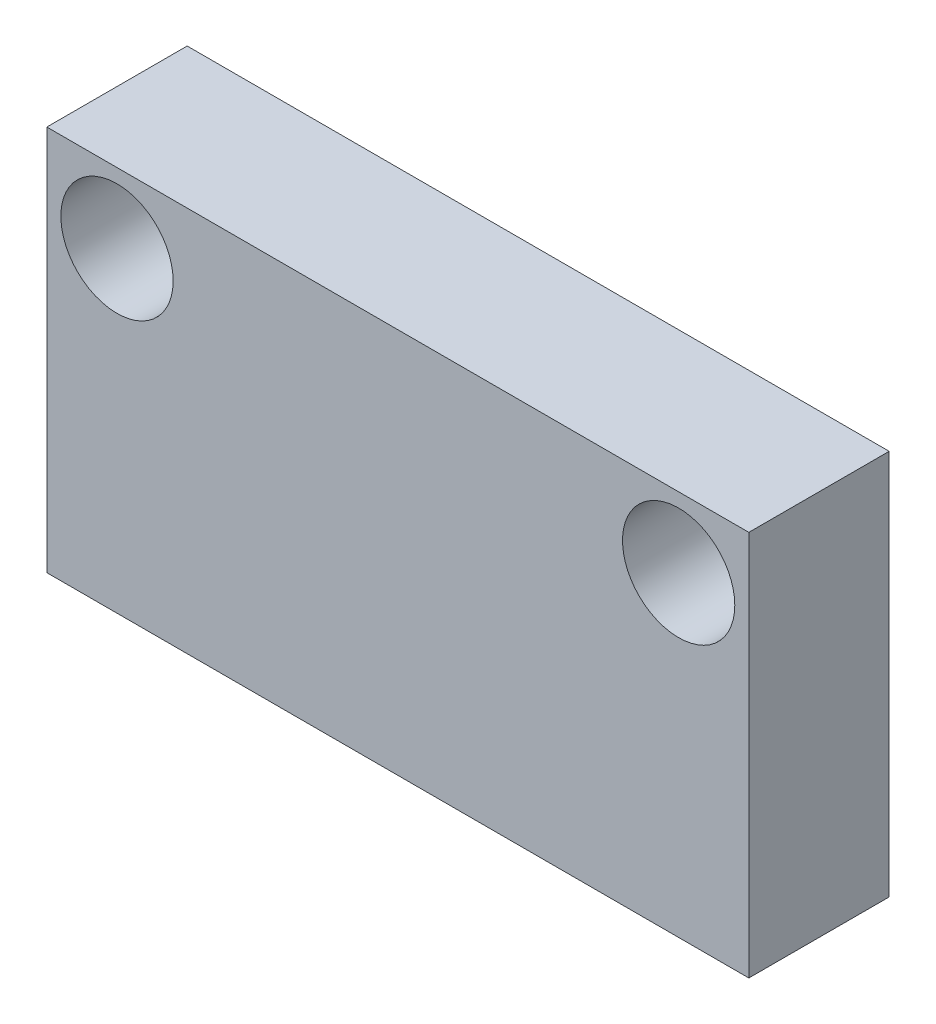
ISO-10303-21;
HEADER;
FILE_DESCRIPTION(('STEP AP214'),'2;1');
FILE_NAME('part.step','',(''),(''),'','','');
FILE_SCHEMA(('AUTOMOTIVE_DESIGN { 1 0 10303 214 1 1 1 1 }'));
ENDSEC;
DATA;
#1=APPLICATION_CONTEXT('core data for automotive mechanical design processes');
#2=APPLICATION_PROTOCOL_DEFINITION('international standard','automotive_design',2000,#1);
#3=PRODUCT_CONTEXT('',#1,'mechanical');
#4=PRODUCT('Part','Part','',(#3));
#5=PRODUCT_RELATED_PRODUCT_CATEGORY('part','',(#4));
#6=PRODUCT_DEFINITION_FORMATION('','',#4);
#7=PRODUCT_DEFINITION_CONTEXT('part definition',#1,'design');
#8=PRODUCT_DEFINITION('design','',#6,#7);
#9=PRODUCT_DEFINITION_SHAPE('','',#8);
#10=(LENGTH_UNIT() NAMED_UNIT(*) SI_UNIT(.MILLI.,.METRE.));
#11=(NAMED_UNIT(*) PLANE_ANGLE_UNIT() SI_UNIT($,.RADIAN.));
#12=(NAMED_UNIT(*) SI_UNIT($,.STERADIAN.) SOLID_ANGLE_UNIT());
#13=UNCERTAINTY_MEASURE_WITH_UNIT(LENGTH_MEASURE(1.E-05),#10,'distance_accuracy_value','');
#14=(GEOMETRIC_REPRESENTATION_CONTEXT(3) GLOBAL_UNCERTAINTY_ASSIGNED_CONTEXT((#13)) GLOBAL_UNIT_ASSIGNED_CONTEXT((#10,
#11,#12)) REPRESENTATION_CONTEXT('',''));
#15=CARTESIAN_POINT('',(0.,0.,0.));
#16=DIRECTION('',(0.,0.,1.));
#17=DIRECTION('',(1.,0.,0.));
#18=AXIS2_PLACEMENT_3D('',#15,#16,#17);
#19=CARTESIAN_POINT('',(20.6185390455556,7.99999999999992,4.));
#20=DIRECTION('',(1.,0.,0.));
#21=DIRECTION('',(0.,0.,-1.));
#22=AXIS2_PLACEMENT_3D('',#19,#20,#21);
#23=PLANE('',#22);
#24=DIRECTION('',(0.,-1.,0.));
#25=VECTOR('',#24,1.);
#26=CARTESIAN_POINT('',(20.6185390455556,7.99999999999992,0.));
#27=LINE('',#26,#25);
#28=CARTESIAN_POINT('',(20.6185390455556,7.99999999999992,0.));
#29=VERTEX_POINT('',#28);
#30=CARTESIAN_POINT('',(20.6185390455556,-3.00000000000015,0.));
#31=VERTEX_POINT('',#30);
#32=EDGE_CURVE('E95',#29,#31,#27,.T.);
#33=ORIENTED_EDGE('',*,*,#32,.T.);
#34=DIRECTION('',(0.,0.,-1.));
#35=VECTOR('',#34,1.);
#36=CARTESIAN_POINT('',(20.6185390455556,-3.00000000000015,4.));
#37=LINE('',#36,#35);
#38=CARTESIAN_POINT('',(20.6185390455556,-3.00000000000015,4.));
#39=VERTEX_POINT('',#38);
#40=EDGE_CURVE('E11',#39,#31,#37,.T.);
#41=ORIENTED_EDGE('',*,*,#40,.F.);
#42=DIRECTION('',(0.,-1.,0.));
#43=VECTOR('',#42,1.);
#44=CARTESIAN_POINT('',(20.6185390455556,7.99999999999992,4.));
#45=LINE('',#44,#43);
#46=CARTESIAN_POINT('',(20.6185390455556,7.99999999999992,4.));
#47=VERTEX_POINT('',#46);
#48=EDGE_CURVE('E83',#47,#39,#45,.T.);
#49=ORIENTED_EDGE('',*,*,#48,.F.);
#50=DIRECTION('',(0.,0.,-1.));
#51=VECTOR('',#50,1.);
#52=CARTESIAN_POINT('',(20.6185390455556,7.99999999999992,4.));
#53=LINE('',#52,#51);
#54=EDGE_CURVE('E91',#47,#29,#53,.T.);
#55=ORIENTED_EDGE('',*,*,#54,.T.);
#56=EDGE_LOOP('',(#33,#41,#49,#55));
#57=FACE_BOUND('',#56,.T.);
#58=ADVANCED_FACE('F32',(#57),#23,.F.);
#59=CARTESIAN_POINT('',(20.6185390455556,-3.00000000000015,4.));
#60=DIRECTION('',(0.,1.,0.));
#61=DIRECTION('',(0.,0.,1.));
#62=AXIS2_PLACEMENT_3D('',#59,#60,#61);
#63=PLANE('',#62);
#64=DIRECTION('',(1.,0.,0.));
#65=VECTOR('',#64,1.);
#66=CARTESIAN_POINT('',(20.6185390455556,-3.00000000000015,0.));
#67=LINE('',#66,#65);
#68=CARTESIAN_POINT('',(40.6261390455556,-3.00000000000015,0.));
#69=VERTEX_POINT('',#68);
#70=EDGE_CURVE('E87',#31,#69,#67,.T.);
#71=ORIENTED_EDGE('',*,*,#70,.T.);
#72=DIRECTION('',(0.,0.,-1.));
#73=VECTOR('',#72,1.);
#74=CARTESIAN_POINT('',(40.6261390455556,-3.00000000000015,4.));
#75=LINE('',#74,#73);
#76=CARTESIAN_POINT('',(40.6261390455556,-3.00000000000015,4.));
#77=VERTEX_POINT('',#76);
#78=EDGE_CURVE('E40',#77,#69,#75,.T.);
#79=ORIENTED_EDGE('',*,*,#78,.F.);
#80=DIRECTION('',(1.,0.,0.));
#81=VECTOR('',#80,1.);
#82=CARTESIAN_POINT('',(20.6185390455556,-3.00000000000015,4.));
#83=LINE('',#82,#81);
#84=EDGE_CURVE('E78',#39,#77,#83,.T.);
#85=ORIENTED_EDGE('',*,*,#84,.F.);
#86=ORIENTED_EDGE('',*,*,#40,.T.);
#87=EDGE_LOOP('',(#71,#79,#85,#86));
#88=FACE_BOUND('',#87,.T.);
#89=ADVANCED_FACE('F86',(#88),#63,.F.);
#90=CARTESIAN_POINT('',(40.6261390455556,7.99999999999992,4.));
#91=DIRECTION('',(-1.,0.,0.));
#92=DIRECTION('',(0.,0.,1.));
#93=AXIS2_PLACEMENT_3D('',#90,#91,#92);
#94=PLANE('',#93);
#95=DIRECTION('',(0.,1.,0.));
#96=VECTOR('',#95,1.);
#97=CARTESIAN_POINT('',(40.6261390455556,7.99999999999992,0.));
#98=LINE('',#97,#96);
#99=CARTESIAN_POINT('',(40.6261390455556,7.99999999999992,0.));
#100=VERTEX_POINT('',#99);
#101=EDGE_CURVE('E65',#69,#100,#98,.T.);
#102=ORIENTED_EDGE('',*,*,#101,.T.);
#103=DIRECTION('',(0.,0.,-1.));
#104=VECTOR('',#103,1.);
#105=CARTESIAN_POINT('',(40.6261390455556,7.99999999999992,4.));
#106=LINE('',#105,#104);
#107=CARTESIAN_POINT('',(40.6261390455556,7.99999999999992,4.));
#108=VERTEX_POINT('',#107);
#109=EDGE_CURVE('E88',#108,#100,#106,.T.);
#110=ORIENTED_EDGE('',*,*,#109,.F.);
#111=DIRECTION('',(0.,1.,0.));
#112=VECTOR('',#111,1.);
#113=CARTESIAN_POINT('',(40.6261390455556,7.99999999999992,4.));
#114=LINE('',#113,#112);
#115=EDGE_CURVE('E81',#77,#108,#114,.T.);
#116=ORIENTED_EDGE('',*,*,#115,.F.);
#117=ORIENTED_EDGE('',*,*,#78,.T.);
#118=EDGE_LOOP('',(#102,#110,#116,#117));
#119=FACE_BOUND('',#118,.T.);
#120=ADVANCED_FACE('F89',(#119),#94,.F.);
#121=CARTESIAN_POINT('',(20.6185390455556,7.99999999999992,4.));
#122=DIRECTION('',(0.,-1.,0.));
#123=DIRECTION('',(0.,0.,-1.));
#124=AXIS2_PLACEMENT_3D('',#121,#122,#123);
#125=PLANE('',#124);
#126=DIRECTION('',(-1.,0.,0.));
#127=VECTOR('',#126,1.);
#128=CARTESIAN_POINT('',(20.6185390455556,7.99999999999992,0.));
#129=LINE('',#128,#127);
#130=EDGE_CURVE('E71',#100,#29,#129,.T.);
#131=ORIENTED_EDGE('',*,*,#130,.T.);
#132=ORIENTED_EDGE('',*,*,#54,.F.);
#133=DIRECTION('',(-1.,0.,0.));
#134=VECTOR('',#133,1.);
#135=CARTESIAN_POINT('',(20.6185390455556,7.99999999999992,4.));
#136=LINE('',#135,#134);
#137=EDGE_CURVE('E48',#108,#47,#136,.T.);
#138=ORIENTED_EDGE('',*,*,#137,.F.);
#139=ORIENTED_EDGE('',*,*,#109,.T.);
#140=EDGE_LOOP('',(#131,#132,#138,#139));
#141=FACE_BOUND('',#140,.T.);
#142=ADVANCED_FACE('F103',(#141),#125,.F.);
#143=CARTESIAN_POINT('',(0.,0.,4.));
#144=DIRECTION('',(0.,0.,1.));
#145=DIRECTION('',(1.,0.,0.));
#146=AXIS2_PLACEMENT_3D('',#143,#144,#145);
#147=PLANE('',#146);
#148=CARTESIAN_POINT('',(38.6261390455588,6.00000000000034,4.));
#149=DIRECTION('',(0.,0.,1.));
#150=DIRECTION('',(1.,0.,0.));
#151=AXIS2_PLACEMENT_3D('',#148,#149,#150);
#152=CIRCLE('',#151,1.59999999999998);
#153=CARTESIAN_POINT('',(40.2261390455588,6.00000000000034,4.));
#154=VERTEX_POINT('',#153);
#155=EDGE_CURVE('E117',#154,#154,#152,.T.);
#156=ORIENTED_EDGE('',*,*,#155,.F.);
#157=EDGE_LOOP('',(#156));
#158=FACE_BOUND('',#157,.T.);
#159=CARTESIAN_POINT('',(22.6185390455556,5.99999999999991,4.));
#160=DIRECTION('',(0.,0.,1.));
#161=DIRECTION('',(1.,0.,0.));
#162=AXIS2_PLACEMENT_3D('',#159,#160,#161);
#163=CIRCLE('',#162,1.59999999999999);
#164=CARTESIAN_POINT('',(24.2185390455556,5.99999999999991,4.));
#165=VERTEX_POINT('',#164);
#166=EDGE_CURVE('E111',#165,#165,#163,.T.);
#167=ORIENTED_EDGE('',*,*,#166,.F.);
#168=EDGE_LOOP('',(#167));
#169=FACE_BOUND('',#168,.T.);
#170=ORIENTED_EDGE('',*,*,#48,.T.);
#171=ORIENTED_EDGE('',*,*,#84,.T.);
#172=ORIENTED_EDGE('',*,*,#115,.T.);
#173=ORIENTED_EDGE('',*,*,#137,.T.);
#174=EDGE_LOOP('',(#170,#171,#172,#173));
#175=FACE_BOUND('',#174,.T.);
#176=ADVANCED_FACE('F79',(#158,#169,#175),#147,.T.);
#177=CARTESIAN_POINT('',(0.,0.,0.));
#178=DIRECTION('',(0.,0.,1.));
#179=DIRECTION('',(1.,0.,0.));
#180=AXIS2_PLACEMENT_3D('',#177,#178,#179);
#181=PLANE('',#180);
#182=CARTESIAN_POINT('',(38.6261390455588,6.00000000000034,0.));
#183=DIRECTION('',(0.,0.,1.));
#184=DIRECTION('',(1.,0.,0.));
#185=AXIS2_PLACEMENT_3D('',#182,#183,#184);
#186=CIRCLE('',#185,1.59999999999999);
#187=CARTESIAN_POINT('',(40.2261390455588,6.00000000000034,0.));
#188=VERTEX_POINT('',#187);
#189=EDGE_CURVE('E114',#188,#188,#186,.T.);
#190=ORIENTED_EDGE('',*,*,#189,.T.);
#191=EDGE_LOOP('',(#190));
#192=FACE_BOUND('',#191,.T.);
#193=CARTESIAN_POINT('',(22.6185390455556,5.99999999999991,0.));
#194=DIRECTION('',(0.,0.,1.));
#195=DIRECTION('',(1.,0.,0.));
#196=AXIS2_PLACEMENT_3D('',#193,#194,#195);
#197=CIRCLE('',#196,1.59999999999999);
#198=CARTESIAN_POINT('',(24.2185390455556,5.99999999999991,0.));
#199=VERTEX_POINT('',#198);
#200=EDGE_CURVE('E98',#199,#199,#197,.T.);
#201=ORIENTED_EDGE('',*,*,#200,.T.);
#202=EDGE_LOOP('',(#201));
#203=FACE_BOUND('',#202,.T.);
#204=ORIENTED_EDGE('',*,*,#32,.F.);
#205=ORIENTED_EDGE('',*,*,#130,.F.);
#206=ORIENTED_EDGE('',*,*,#101,.F.);
#207=ORIENTED_EDGE('',*,*,#70,.F.);
#208=EDGE_LOOP('',(#204,#205,#206,#207));
#209=FACE_BOUND('',#208,.T.);
#210=ADVANCED_FACE('F106',(#192,#203,#209),#181,.F.);
#211=CARTESIAN_POINT('',(22.6185390455556,5.99999999999991,4.));
#212=DIRECTION('',(0.,0.,1.));
#213=DIRECTION('',(1.,0.,0.));
#214=AXIS2_PLACEMENT_3D('',#211,#212,#213);
#215=CYLINDRICAL_SURFACE('',#214,1.59999999999999);
#216=ORIENTED_EDGE('',*,*,#200,.F.);
#217=EDGE_LOOP('',(#216));
#218=FACE_BOUND('',#217,.T.);
#219=ORIENTED_EDGE('',*,*,#166,.T.);
#220=EDGE_LOOP('',(#219));
#221=FACE_BOUND('',#220,.T.);
#222=ADVANCED_FACE('F128',(#218,#221),#215,.F.);
#223=CARTESIAN_POINT('',(38.6261390455588,6.00000000000034,4.));
#224=DIRECTION('',(0.,0.,1.));
#225=DIRECTION('',(1.,0.,0.));
#226=AXIS2_PLACEMENT_3D('',#223,#224,#225);
#227=CYLINDRICAL_SURFACE('',#226,1.59999999999999);
#228=ORIENTED_EDGE('',*,*,#189,.F.);
#229=EDGE_LOOP('',(#228));
#230=FACE_BOUND('',#229,.T.);
#231=ORIENTED_EDGE('',*,*,#155,.T.);
#232=EDGE_LOOP('',(#231));
#233=FACE_BOUND('',#232,.T.);
#234=ADVANCED_FACE('F121',(#230,#233),#227,.F.);
#235=CLOSED_SHELL('',(#58,#89,#120,#142,#176,#210,#222,#234));
#236=MANIFOLD_SOLID_BREP('B2',#235);
#237=ADVANCED_BREP_SHAPE_REPRESENTATION('',(#18,#236),#14);
#238=SHAPE_DEFINITION_REPRESENTATION(#9,#237);
ENDSEC;
END-ISO-10303-21;
